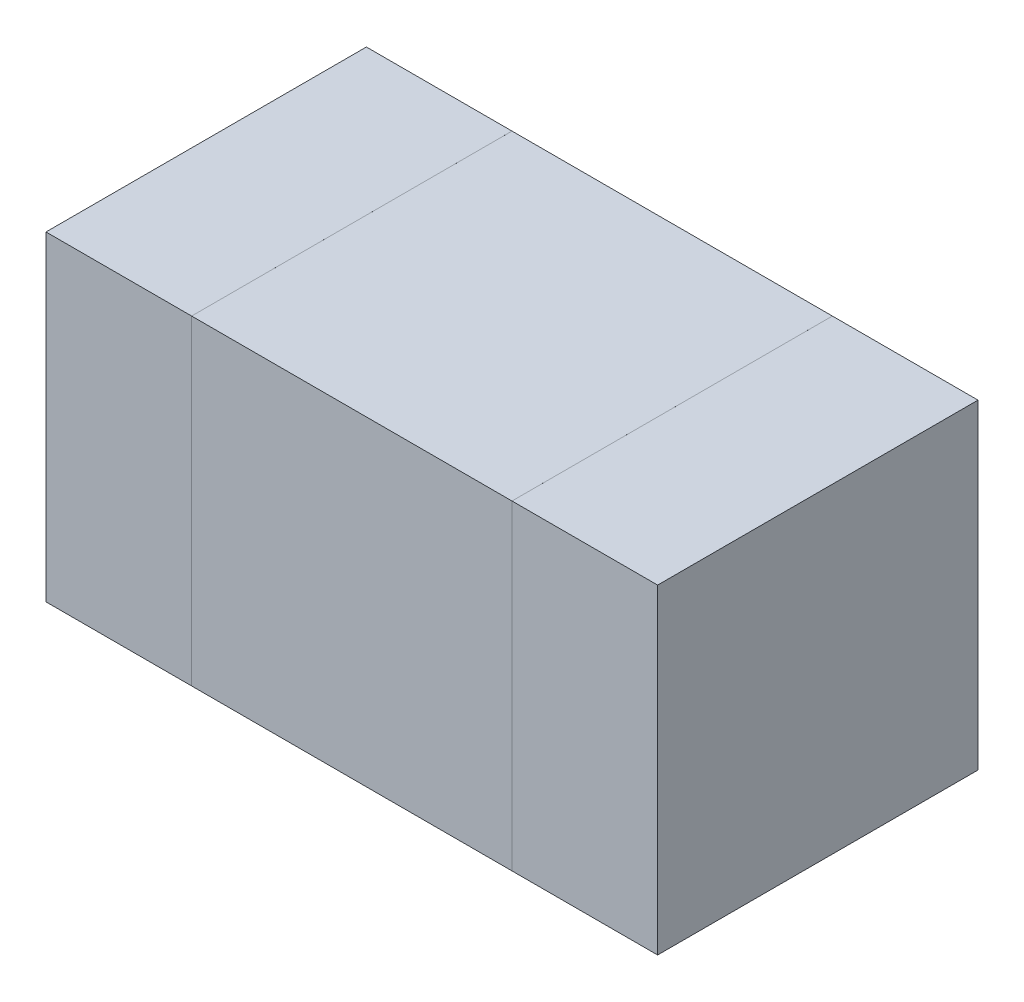
ISO-10303-21;
HEADER;
FILE_DESCRIPTION(('STEP AP214'),'2;1');
FILE_NAME('part.step','',(''),(''),'','','');
FILE_SCHEMA(('AUTOMOTIVE_DESIGN { 1 0 10303 214 1 1 1 1 }'));
ENDSEC;
DATA;
#1=APPLICATION_CONTEXT('core data for automotive mechanical design processes');
#2=APPLICATION_PROTOCOL_DEFINITION('international standard','automotive_design',2000,#1);
#3=PRODUCT_CONTEXT('',#1,'mechanical');
#4=PRODUCT('Part','Part','',(#3));
#5=PRODUCT_RELATED_PRODUCT_CATEGORY('part','',(#4));
#6=PRODUCT_DEFINITION_FORMATION('','',#4);
#7=PRODUCT_DEFINITION_CONTEXT('part definition',#1,'design');
#8=PRODUCT_DEFINITION('design','',#6,#7);
#9=PRODUCT_DEFINITION_SHAPE('','',#8);
#10=(LENGTH_UNIT() NAMED_UNIT(*) SI_UNIT(.MILLI.,.METRE.));
#11=(NAMED_UNIT(*) PLANE_ANGLE_UNIT() SI_UNIT($,.RADIAN.));
#12=(NAMED_UNIT(*) SI_UNIT($,.STERADIAN.) SOLID_ANGLE_UNIT());
#13=UNCERTAINTY_MEASURE_WITH_UNIT(LENGTH_MEASURE(1.E-05),#10,'distance_accuracy_value','');
#14=(GEOMETRIC_REPRESENTATION_CONTEXT(3) GLOBAL_UNCERTAINTY_ASSIGNED_CONTEXT((#13)) GLOBAL_UNIT_ASSIGNED_CONTEXT((#10,
#11,#12)) REPRESENTATION_CONTEXT('',''));
#15=CARTESIAN_POINT('',(0.,0.,0.));
#16=DIRECTION('',(0.,0.,1.));
#17=DIRECTION('',(1.,0.,0.));
#18=AXIS2_PLACEMENT_3D('',#15,#16,#17);
#19=CARTESIAN_POINT('',(5.909997077695,8.734999960195,0.32999934));
#20=DIRECTION('',(0.,0.,-1.));
#21=DIRECTION('',(0.,-1.,0.));
#22=AXIS2_PLACEMENT_3D('',#19,#20,#21);
#23=PLANE('',#22);
#24=DIRECTION('',(1.,0.,0.));
#25=VECTOR('',#24,1.);
#26=CARTESIAN_POINT('',(5.909997077695,8.734999960195,0.32999934));
#27=LINE('',#26,#25);
#28=CARTESIAN_POINT('',(5.909997077695,8.734999960195,0.32999934));
#29=VERTEX_POINT('',#28);
#30=CARTESIAN_POINT('',(6.239998957695,8.734999960195,0.32999934));
#31=VERTEX_POINT('',#30);
#32=EDGE_CURVE('P0_E83',#29,#31,#27,.T.);
#33=ORIENTED_EDGE('',*,*,#32,.T.);
#34=DIRECTION('',(0.,1.,0.));
#35=VECTOR('',#34,1.);
#36=CARTESIAN_POINT('',(6.239998957695,8.734999960195,0.32999934));
#37=LINE('',#36,#35);
#38=CARTESIAN_POINT('',(6.239998957695,9.064999300195,0.32999934));
#39=VERTEX_POINT('',#38);
#40=EDGE_CURVE('P0_E102',#31,#39,#37,.T.);
#41=ORIENTED_EDGE('',*,*,#40,.T.);
#42=DIRECTION('',(-1.,0.,0.));
#43=VECTOR('',#42,1.);
#44=CARTESIAN_POINT('',(6.239998957695,9.064999300195,0.32999934));
#45=LINE('',#44,#43);
#46=CARTESIAN_POINT('',(5.909997077695,9.064999300195,0.32999934));
#47=VERTEX_POINT('',#46);
#48=EDGE_CURVE('P0_E20',#39,#47,#45,.T.);
#49=ORIENTED_EDGE('',*,*,#48,.T.);
#50=DIRECTION('',(0.,-1.,0.));
#51=VECTOR('',#50,1.);
#52=CARTESIAN_POINT('',(5.909997077695,9.064999300195,0.32999934));
#53=LINE('',#52,#51);
#54=EDGE_CURVE('P0_E11',#47,#29,#53,.T.);
#55=ORIENTED_EDGE('',*,*,#54,.T.);
#56=EDGE_LOOP('',(#33,#41,#49,#55));
#57=FACE_BOUND('',#56,.T.);
#58=ADVANCED_FACE('P0_F17',(#57),#23,.F.);
#59=CARTESIAN_POINT('',(5.909997077695,8.734999960195,0.));
#60=DIRECTION('',(0.,0.,-1.));
#61=DIRECTION('',(0.,-1.,0.));
#62=AXIS2_PLACEMENT_3D('',#59,#60,#61);
#63=PLANE('',#62);
#64=DIRECTION('',(0.,-1.,0.));
#65=VECTOR('',#64,1.);
#66=CARTESIAN_POINT('',(5.909997077695,9.064999300195,0.));
#67=LINE('',#66,#65);
#68=CARTESIAN_POINT('',(5.909997077695,9.064999300195,0.));
#69=VERTEX_POINT('',#68);
#70=CARTESIAN_POINT('',(5.909997077695,8.734999960195,0.));
#71=VERTEX_POINT('',#70);
#72=EDGE_CURVE('P0_E26',#69,#71,#67,.T.);
#73=ORIENTED_EDGE('',*,*,#72,.F.);
#74=DIRECTION('',(-1.,0.,0.));
#75=VECTOR('',#74,1.);
#76=CARTESIAN_POINT('',(6.239998957695,9.064999300195,0.));
#77=LINE('',#76,#75);
#78=CARTESIAN_POINT('',(6.239998957695,9.064999300195,0.));
#79=VERTEX_POINT('',#78);
#80=EDGE_CURVE('P0_E106',#79,#69,#77,.T.);
#81=ORIENTED_EDGE('',*,*,#80,.F.);
#82=DIRECTION('',(0.,1.,0.));
#83=VECTOR('',#82,1.);
#84=CARTESIAN_POINT('',(6.239998957695,8.734999960195,0.));
#85=LINE('',#84,#83);
#86=CARTESIAN_POINT('',(6.239998957695,8.734999960195,0.));
#87=VERTEX_POINT('',#86);
#88=EDGE_CURVE('P0_E85',#87,#79,#85,.T.);
#89=ORIENTED_EDGE('',*,*,#88,.F.);
#90=DIRECTION('',(1.,0.,0.));
#91=VECTOR('',#90,1.);
#92=CARTESIAN_POINT('',(5.909997077695,8.734999960195,0.));
#93=LINE('',#92,#91);
#94=EDGE_CURVE('P0_E81',#71,#87,#93,.T.);
#95=ORIENTED_EDGE('',*,*,#94,.F.);
#96=EDGE_LOOP('',(#73,#81,#89,#95));
#97=FACE_BOUND('',#96,.T.);
#98=ADVANCED_FACE('P0_F87',(#97),#63,.T.);
#99=CARTESIAN_POINT('',(5.909997077695,9.064999300195,0.));
#100=DIRECTION('',(1.,0.,0.));
#101=DIRECTION('',(0.,1.,0.));
#102=AXIS2_PLACEMENT_3D('',#99,#100,#101);
#103=PLANE('',#102);
#104=ORIENTED_EDGE('',*,*,#72,.T.);
#105=DIRECTION('',(0.,0.,1.));
#106=VECTOR('',#105,1.);
#107=CARTESIAN_POINT('',(5.909997077695,8.734999960195,0.));
#108=LINE('',#107,#106);
#109=EDGE_CURVE('P0_E70',#71,#29,#108,.T.);
#110=ORIENTED_EDGE('',*,*,#109,.T.);
#111=ORIENTED_EDGE('',*,*,#54,.F.);
#112=DIRECTION('',(0.,0.,1.));
#113=VECTOR('',#112,1.);
#114=CARTESIAN_POINT('',(5.909997077695,9.064999300195,0.));
#115=LINE('',#114,#113);
#116=EDGE_CURVE('P0_E73',#69,#47,#115,.T.);
#117=ORIENTED_EDGE('',*,*,#116,.F.);
#118=EDGE_LOOP('',(#104,#110,#111,#117));
#119=FACE_BOUND('',#118,.T.);
#120=ADVANCED_FACE('P0_F69',(#119),#103,.F.);
#121=CARTESIAN_POINT('',(6.239998957695,9.064999300195,0.));
#122=DIRECTION('',(0.,-1.,0.));
#123=DIRECTION('',(0.,0.,-1.));
#124=AXIS2_PLACEMENT_3D('',#121,#122,#123);
#125=PLANE('',#124);
#126=ORIENTED_EDGE('',*,*,#80,.T.);
#127=ORIENTED_EDGE('',*,*,#116,.T.);
#128=ORIENTED_EDGE('',*,*,#48,.F.);
#129=DIRECTION('',(0.,0.,1.));
#130=VECTOR('',#129,1.);
#131=CARTESIAN_POINT('',(6.239998957695,9.064999300195,0.));
#132=LINE('',#131,#130);
#133=EDGE_CURVE('P0_E100',#79,#39,#132,.T.);
#134=ORIENTED_EDGE('',*,*,#133,.F.);
#135=EDGE_LOOP('',(#126,#127,#128,#134));
#136=FACE_BOUND('',#135,.T.);
#137=ADVANCED_FACE('P0_F119',(#136),#125,.F.);
#138=CARTESIAN_POINT('',(6.239998957695,8.734999960195,0.));
#139=DIRECTION('',(-1.,0.,0.));
#140=DIRECTION('',(0.,0.,1.));
#141=AXIS2_PLACEMENT_3D('',#138,#139,#140);
#142=PLANE('',#141);
#143=ORIENTED_EDGE('',*,*,#88,.T.);
#144=ORIENTED_EDGE('',*,*,#133,.T.);
#145=ORIENTED_EDGE('',*,*,#40,.F.);
#146=DIRECTION('',(0.,0.,1.));
#147=VECTOR('',#146,1.);
#148=CARTESIAN_POINT('',(6.239998957695,8.734999960195,0.));
#149=LINE('',#148,#147);
#150=EDGE_CURVE('P0_E91',#87,#31,#149,.T.);
#151=ORIENTED_EDGE('',*,*,#150,.F.);
#152=EDGE_LOOP('',(#143,#144,#145,#151));
#153=FACE_BOUND('',#152,.T.);
#154=ADVANCED_FACE('P0_F121',(#153),#142,.F.);
#155=CARTESIAN_POINT('',(5.909997077695,8.734999960195,0.));
#156=DIRECTION('',(0.,1.,0.));
#157=DIRECTION('',(1.,0.,0.));
#158=AXIS2_PLACEMENT_3D('',#155,#156,#157);
#159=PLANE('',#158);
#160=ORIENTED_EDGE('',*,*,#94,.T.);
#161=ORIENTED_EDGE('',*,*,#150,.T.);
#162=ORIENTED_EDGE('',*,*,#32,.F.);
#163=ORIENTED_EDGE('',*,*,#109,.F.);
#164=EDGE_LOOP('',(#160,#161,#162,#163));
#165=FACE_BOUND('',#164,.T.);
#166=ADVANCED_FACE('P0_F79',(#165),#159,.F.);
#167=CLOSED_SHELL('',(#58,#98,#120,#137,#154,#166));
#168=MANIFOLD_SOLID_BREP('P0_B1',#167);
#169=CARTESIAN_POINT('',(6.390004630859,8.734997420195,0.32999934));
#170=DIRECTION('',(0.,0.,-1.));
#171=DIRECTION('',(0.,-1.,0.));
#172=AXIS2_PLACEMENT_3D('',#169,#170,#171);
#173=PLANE('',#172);
#174=DIRECTION('',(0.,1.,0.));
#175=VECTOR('',#174,1.);
#176=CARTESIAN_POINT('',(6.390004630859,8.734997420195,0.32999934));
#177=LINE('',#176,#175);
#178=CARTESIAN_POINT('',(6.390004630859,8.734997420195,0.32999934));
#179=VERTEX_POINT('',#178);
#180=CARTESIAN_POINT('',(6.390004630859,9.064999300195,0.32999934));
#181=VERTEX_POINT('',#180);
#182=EDGE_CURVE('P1_E82',#179,#181,#177,.T.);
#183=ORIENTED_EDGE('',*,*,#182,.T.);
#184=DIRECTION('',(-1.,0.,0.));
#185=VECTOR('',#184,1.);
#186=CARTESIAN_POINT('',(6.390004630859,9.064999300195,0.32999934));
#187=LINE('',#186,#185);
#188=CARTESIAN_POINT('',(6.240002390859,9.064999300195,0.32999934));
#189=VERTEX_POINT('',#188);
#190=EDGE_CURVE('P1_E98',#181,#189,#187,.T.);
#191=ORIENTED_EDGE('',*,*,#190,.T.);
#192=DIRECTION('',(0.,-1.,0.));
#193=VECTOR('',#192,1.);
#194=CARTESIAN_POINT('',(6.240002390859,9.064999300195,0.32999934));
#195=LINE('',#194,#193);
#196=CARTESIAN_POINT('',(6.240002390859,8.734997420195,0.32999934));
#197=VERTEX_POINT('',#196);
#198=EDGE_CURVE('P1_E74',#189,#197,#195,.T.);
#199=ORIENTED_EDGE('',*,*,#198,.T.);
#200=DIRECTION('',(1.,0.,0.));
#201=VECTOR('',#200,1.);
#202=CARTESIAN_POINT('',(6.240002390859,8.734997420195,0.32999934));
#203=LINE('',#202,#201);
#204=EDGE_CURVE('P1_E11',#197,#179,#203,.T.);
#205=ORIENTED_EDGE('',*,*,#204,.T.);
#206=EDGE_LOOP('',(#183,#191,#199,#205));
#207=FACE_BOUND('',#206,.T.);
#208=ADVANCED_FACE('P1_F17',(#207),#173,.F.);
#209=CARTESIAN_POINT('',(6.390004630859,8.734997420195,0.));
#210=DIRECTION('',(0.,0.,-1.));
#211=DIRECTION('',(0.,-1.,0.));
#212=AXIS2_PLACEMENT_3D('',#209,#210,#211);
#213=PLANE('',#212);
#214=DIRECTION('',(1.,0.,0.));
#215=VECTOR('',#214,1.);
#216=CARTESIAN_POINT('',(6.240002390859,8.734997420195,0.));
#217=LINE('',#216,#215);
#218=CARTESIAN_POINT('',(6.240002390859,8.734997420195,0.));
#219=VERTEX_POINT('',#218);
#220=CARTESIAN_POINT('',(6.390004630859,8.734997420195,0.));
#221=VERTEX_POINT('',#220);
#222=EDGE_CURVE('P1_E25',#219,#221,#217,.T.);
#223=ORIENTED_EDGE('',*,*,#222,.F.);
#224=DIRECTION('',(0.,-1.,0.));
#225=VECTOR('',#224,1.);
#226=CARTESIAN_POINT('',(6.240002390859,9.064999300195,0.));
#227=LINE('',#226,#225);
#228=CARTESIAN_POINT('',(6.240002390859,9.064999300195,0.));
#229=VERTEX_POINT('',#228);
#230=EDGE_CURVE('P1_E101',#229,#219,#227,.T.);
#231=ORIENTED_EDGE('',*,*,#230,.F.);
#232=DIRECTION('',(-1.,0.,0.));
#233=VECTOR('',#232,1.);
#234=CARTESIAN_POINT('',(6.390004630859,9.064999300195,0.));
#235=LINE('',#234,#233);
#236=CARTESIAN_POINT('',(6.390004630859,9.064999300195,0.));
#237=VERTEX_POINT('',#236);
#238=EDGE_CURVE('P1_E84',#237,#229,#235,.T.);
#239=ORIENTED_EDGE('',*,*,#238,.F.);
#240=DIRECTION('',(0.,1.,0.));
#241=VECTOR('',#240,1.);
#242=CARTESIAN_POINT('',(6.390004630859,8.734997420195,0.));
#243=LINE('',#242,#241);
#244=EDGE_CURVE('P1_E80',#221,#237,#243,.T.);
#245=ORIENTED_EDGE('',*,*,#244,.F.);
#246=EDGE_LOOP('',(#223,#231,#239,#245));
#247=FACE_BOUND('',#246,.T.);
#248=ADVANCED_FACE('P1_F86',(#247),#213,.T.);
#249=CARTESIAN_POINT('',(6.240002390859,8.734997420195,0.));
#250=DIRECTION('',(0.,1.,0.));
#251=DIRECTION('',(1.,0.,0.));
#252=AXIS2_PLACEMENT_3D('',#249,#250,#251);
#253=PLANE('',#252);
#254=ORIENTED_EDGE('',*,*,#222,.T.);
#255=DIRECTION('',(0.,0.,1.));
#256=VECTOR('',#255,1.);
#257=CARTESIAN_POINT('',(6.390004630859,8.734997420195,0.));
#258=LINE('',#257,#256);
#259=EDGE_CURVE('P1_E68',#221,#179,#258,.T.);
#260=ORIENTED_EDGE('',*,*,#259,.T.);
#261=ORIENTED_EDGE('',*,*,#204,.F.);
#262=DIRECTION('',(0.,0.,1.));
#263=VECTOR('',#262,1.);
#264=CARTESIAN_POINT('',(6.240002390859,8.734997420195,0.));
#265=LINE('',#264,#263);
#266=EDGE_CURVE('P1_E71',#219,#197,#265,.T.);
#267=ORIENTED_EDGE('',*,*,#266,.F.);
#268=EDGE_LOOP('',(#254,#260,#261,#267));
#269=FACE_BOUND('',#268,.T.);
#270=ADVANCED_FACE('P1_F67',(#269),#253,.F.);
#271=CARTESIAN_POINT('',(6.240002390859,9.064999300195,0.));
#272=DIRECTION('',(1.,0.,0.));
#273=DIRECTION('',(0.,1.,0.));
#274=AXIS2_PLACEMENT_3D('',#271,#272,#273);
#275=PLANE('',#274);
#276=ORIENTED_EDGE('',*,*,#230,.T.);
#277=ORIENTED_EDGE('',*,*,#266,.T.);
#278=ORIENTED_EDGE('',*,*,#198,.F.);
#279=DIRECTION('',(0.,0.,1.));
#280=VECTOR('',#279,1.);
#281=CARTESIAN_POINT('',(6.240002390859,9.064999300195,0.));
#282=LINE('',#281,#280);
#283=EDGE_CURVE('P1_E102',#229,#189,#282,.T.);
#284=ORIENTED_EDGE('',*,*,#283,.F.);
#285=EDGE_LOOP('',(#276,#277,#278,#284));
#286=FACE_BOUND('',#285,.T.);
#287=ADVANCED_FACE('P1_F115',(#286),#275,.F.);
#288=CARTESIAN_POINT('',(6.390004630859,9.064999300195,0.));
#289=DIRECTION('',(0.,-1.,0.));
#290=DIRECTION('',(0.,0.,-1.));
#291=AXIS2_PLACEMENT_3D('',#288,#289,#290);
#292=PLANE('',#291);
#293=ORIENTED_EDGE('',*,*,#238,.T.);
#294=ORIENTED_EDGE('',*,*,#283,.T.);
#295=ORIENTED_EDGE('',*,*,#190,.F.);
#296=DIRECTION('',(0.,0.,1.));
#297=VECTOR('',#296,1.);
#298=CARTESIAN_POINT('',(6.390004630859,9.064999300195,0.));
#299=LINE('',#298,#297);
#300=EDGE_CURVE('P1_E90',#237,#181,#299,.T.);
#301=ORIENTED_EDGE('',*,*,#300,.F.);
#302=EDGE_LOOP('',(#293,#294,#295,#301));
#303=FACE_BOUND('',#302,.T.);
#304=ADVANCED_FACE('P1_F118',(#303),#292,.F.);
#305=CARTESIAN_POINT('',(6.390004630859,8.734997420195,0.));
#306=DIRECTION('',(-1.,0.,0.));
#307=DIRECTION('',(0.,0.,1.));
#308=AXIS2_PLACEMENT_3D('',#305,#306,#307);
#309=PLANE('',#308);
#310=ORIENTED_EDGE('',*,*,#244,.T.);
#311=ORIENTED_EDGE('',*,*,#300,.T.);
#312=ORIENTED_EDGE('',*,*,#182,.F.);
#313=ORIENTED_EDGE('',*,*,#259,.F.);
#314=EDGE_LOOP('',(#310,#311,#312,#313));
#315=FACE_BOUND('',#314,.T.);
#316=ADVANCED_FACE('P1_F78',(#315),#309,.F.);
#317=CLOSED_SHELL('',(#208,#248,#270,#287,#304,#316));
#318=MANIFOLD_SOLID_BREP('P1_B1',#317);
#319=CARTESIAN_POINT('',(5.909993644531,8.734997420195,0.32999934));
#320=DIRECTION('',(0.,0.,-1.));
#321=DIRECTION('',(0.,-1.,0.));
#322=AXIS2_PLACEMENT_3D('',#319,#320,#321);
#323=PLANE('',#322);
#324=DIRECTION('',(0.,1.,0.));
#325=VECTOR('',#324,1.);
#326=CARTESIAN_POINT('',(5.909993644531,8.734997420195,0.32999934));
#327=LINE('',#326,#325);
#328=CARTESIAN_POINT('',(5.909993644531,8.734997420195,0.32999934));
#329=VERTEX_POINT('',#328);
#330=CARTESIAN_POINT('',(5.909993644531,9.064999300195,0.32999934));
#331=VERTEX_POINT('',#330);
#332=EDGE_CURVE('P2_E82',#329,#331,#327,.T.);
#333=ORIENTED_EDGE('',*,*,#332,.T.);
#334=DIRECTION('',(-1.,0.,0.));
#335=VECTOR('',#334,1.);
#336=CARTESIAN_POINT('',(5.909993644531,9.064999300195,0.32999934));
#337=LINE('',#336,#335);
#338=CARTESIAN_POINT('',(5.759991404531,9.064999300195,0.32999934));
#339=VERTEX_POINT('',#338);
#340=EDGE_CURVE('P2_E99',#331,#339,#337,.T.);
#341=ORIENTED_EDGE('',*,*,#340,.T.);
#342=DIRECTION('',(0.,-1.,0.));
#343=VECTOR('',#342,1.);
#344=CARTESIAN_POINT('',(5.759991404531,9.064999300195,0.32999934));
#345=LINE('',#344,#343);
#346=CARTESIAN_POINT('',(5.759991404531,8.734997420195,0.32999934));
#347=VERTEX_POINT('',#346);
#348=EDGE_CURVE('P2_E75',#339,#347,#345,.T.);
#349=ORIENTED_EDGE('',*,*,#348,.T.);
#350=DIRECTION('',(1.,0.,0.));
#351=VECTOR('',#350,1.);
#352=CARTESIAN_POINT('',(5.759991404531,8.734997420195,0.32999934));
#353=LINE('',#352,#351);
#354=EDGE_CURVE('P2_E11',#347,#329,#353,.T.);
#355=ORIENTED_EDGE('',*,*,#354,.T.);
#356=EDGE_LOOP('',(#333,#341,#349,#355));
#357=FACE_BOUND('',#356,.T.);
#358=ADVANCED_FACE('P2_F17',(#357),#323,.F.);
#359=CARTESIAN_POINT('',(5.909993644531,8.734997420195,0.));
#360=DIRECTION('',(0.,0.,-1.));
#361=DIRECTION('',(0.,-1.,0.));
#362=AXIS2_PLACEMENT_3D('',#359,#360,#361);
#363=PLANE('',#362);
#364=DIRECTION('',(1.,0.,0.));
#365=VECTOR('',#364,1.);
#366=CARTESIAN_POINT('',(5.759991404531,8.734997420195,0.));
#367=LINE('',#366,#365);
#368=CARTESIAN_POINT('',(5.759991404531,8.734997420195,0.));
#369=VERTEX_POINT('',#368);
#370=CARTESIAN_POINT('',(5.909993644531,8.734997420195,0.));
#371=VERTEX_POINT('',#370);
#372=EDGE_CURVE('P2_E20',#369,#371,#367,.T.);
#373=ORIENTED_EDGE('',*,*,#372,.F.);
#374=DIRECTION('',(0.,-1.,0.));
#375=VECTOR('',#374,1.);
#376=CARTESIAN_POINT('',(5.759991404531,9.064999300195,0.));
#377=LINE('',#376,#375);
#378=CARTESIAN_POINT('',(5.759991404531,9.064999300195,0.));
#379=VERTEX_POINT('',#378);
#380=EDGE_CURVE('P2_E96',#379,#369,#377,.T.);
#381=ORIENTED_EDGE('',*,*,#380,.F.);
#382=DIRECTION('',(-1.,0.,0.));
#383=VECTOR('',#382,1.);
#384=CARTESIAN_POINT('',(5.909993644531,9.064999300195,0.));
#385=LINE('',#384,#383);
#386=CARTESIAN_POINT('',(5.909993644531,9.064999300195,0.));
#387=VERTEX_POINT('',#386);
#388=EDGE_CURVE('P2_E84',#387,#379,#385,.T.);
#389=ORIENTED_EDGE('',*,*,#388,.F.);
#390=DIRECTION('',(0.,1.,0.));
#391=VECTOR('',#390,1.);
#392=CARTESIAN_POINT('',(5.909993644531,8.734997420195,0.));
#393=LINE('',#392,#391);
#394=EDGE_CURVE('P2_E80',#371,#387,#393,.T.);
#395=ORIENTED_EDGE('',*,*,#394,.F.);
#396=EDGE_LOOP('',(#373,#381,#389,#395));
#397=FACE_BOUND('',#396,.T.);
#398=ADVANCED_FACE('P2_F86',(#397),#363,.T.);
#399=CARTESIAN_POINT('',(5.759991404531,8.734997420195,0.));
#400=DIRECTION('',(0.,1.,0.));
#401=DIRECTION('',(1.,0.,0.));
#402=AXIS2_PLACEMENT_3D('',#399,#400,#401);
#403=PLANE('',#402);
#404=ORIENTED_EDGE('',*,*,#372,.T.);
#405=DIRECTION('',(0.,0.,1.));
#406=VECTOR('',#405,1.);
#407=CARTESIAN_POINT('',(5.909993644531,8.734997420195,0.));
#408=LINE('',#407,#406);
#409=EDGE_CURVE('P2_E69',#371,#329,#408,.T.);
#410=ORIENTED_EDGE('',*,*,#409,.T.);
#411=ORIENTED_EDGE('',*,*,#354,.F.);
#412=DIRECTION('',(0.,0.,1.));
#413=VECTOR('',#412,1.);
#414=CARTESIAN_POINT('',(5.759991404531,8.734997420195,0.));
#415=LINE('',#414,#413);
#416=EDGE_CURVE('P2_E72',#369,#347,#415,.T.);
#417=ORIENTED_EDGE('',*,*,#416,.F.);
#418=EDGE_LOOP('',(#404,#410,#411,#417));
#419=FACE_BOUND('',#418,.T.);
#420=ADVANCED_FACE('P2_F68',(#419),#403,.F.);
#421=CARTESIAN_POINT('',(5.759991404531,9.064999300195,0.));
#422=DIRECTION('',(1.,0.,0.));
#423=DIRECTION('',(0.,1.,0.));
#424=AXIS2_PLACEMENT_3D('',#421,#422,#423);
#425=PLANE('',#424);
#426=ORIENTED_EDGE('',*,*,#380,.T.);
#427=ORIENTED_EDGE('',*,*,#416,.T.);
#428=ORIENTED_EDGE('',*,*,#348,.F.);
#429=DIRECTION('',(0.,0.,1.));
#430=VECTOR('',#429,1.);
#431=CARTESIAN_POINT('',(5.759991404531,9.064999300195,0.));
#432=LINE('',#431,#430);
#433=EDGE_CURVE('P2_E106',#379,#339,#432,.T.);
#434=ORIENTED_EDGE('',*,*,#433,.F.);
#435=EDGE_LOOP('',(#426,#427,#428,#434));
#436=FACE_BOUND('',#435,.T.);
#437=ADVANCED_FACE('P2_F115',(#436),#425,.F.);
#438=CARTESIAN_POINT('',(5.909993644531,9.064999300195,0.));
#439=DIRECTION('',(0.,-1.,0.));
#440=DIRECTION('',(0.,0.,-1.));
#441=AXIS2_PLACEMENT_3D('',#438,#439,#440);
#442=PLANE('',#441);
#443=ORIENTED_EDGE('',*,*,#388,.T.);
#444=ORIENTED_EDGE('',*,*,#433,.T.);
#445=ORIENTED_EDGE('',*,*,#340,.F.);
#446=DIRECTION('',(0.,0.,1.));
#447=VECTOR('',#446,1.);
#448=CARTESIAN_POINT('',(5.909993644531,9.064999300195,0.));
#449=LINE('',#448,#447);
#450=EDGE_CURVE('P2_E90',#387,#331,#449,.T.);
#451=ORIENTED_EDGE('',*,*,#450,.F.);
#452=EDGE_LOOP('',(#443,#444,#445,#451));
#453=FACE_BOUND('',#452,.T.);
#454=ADVANCED_FACE('P2_F118',(#453),#442,.F.);
#455=CARTESIAN_POINT('',(5.909993644531,8.734997420195,0.));
#456=DIRECTION('',(-1.,0.,0.));
#457=DIRECTION('',(0.,0.,1.));
#458=AXIS2_PLACEMENT_3D('',#455,#456,#457);
#459=PLANE('',#458);
#460=ORIENTED_EDGE('',*,*,#394,.T.);
#461=ORIENTED_EDGE('',*,*,#450,.T.);
#462=ORIENTED_EDGE('',*,*,#332,.F.);
#463=ORIENTED_EDGE('',*,*,#409,.F.);
#464=EDGE_LOOP('',(#460,#461,#462,#463));
#465=FACE_BOUND('',#464,.T.);
#466=ADVANCED_FACE('P2_F78',(#465),#459,.F.);
#467=CLOSED_SHELL('',(#358,#398,#420,#437,#454,#466));
#468=MANIFOLD_SOLID_BREP('P2_B1',#467);
#469=ADVANCED_BREP_SHAPE_REPRESENTATION('',(#18,#168,#318,#468),#14);
#470=SHAPE_DEFINITION_REPRESENTATION(#9,#469);
ENDSEC;
END-ISO-10303-21;
